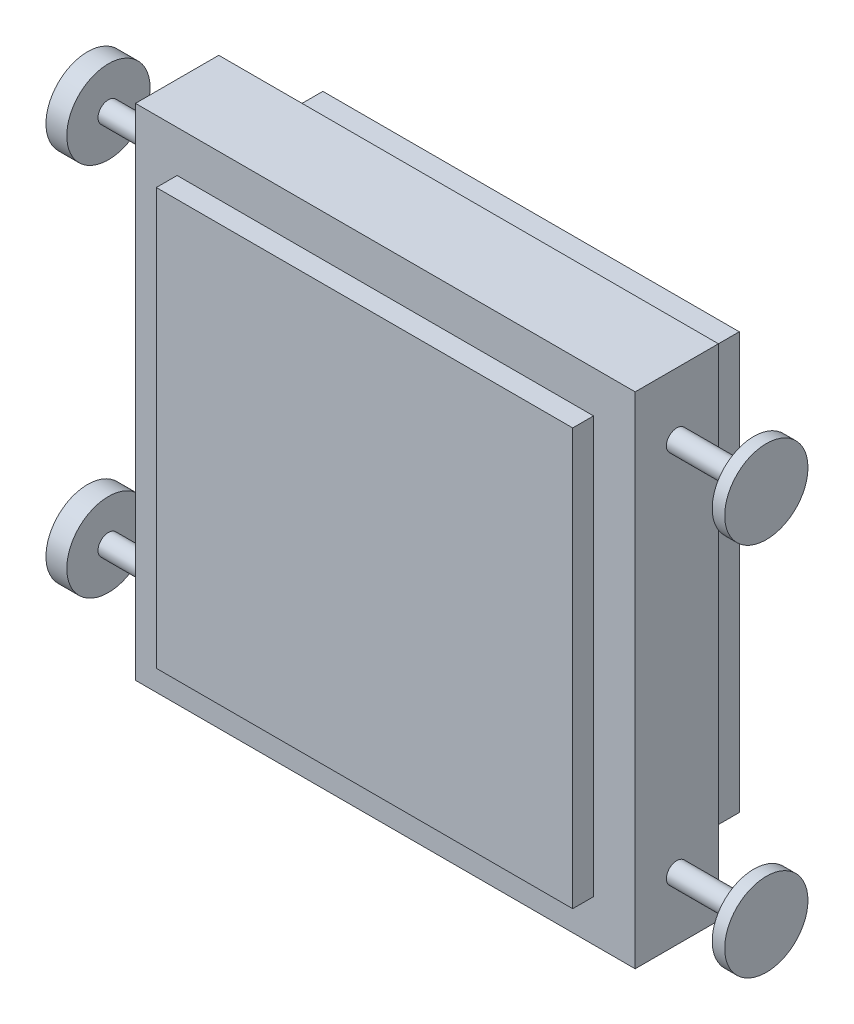
ISO-10303-21;
HEADER;
FILE_DESCRIPTION(('STEP AP214'),'2;1');
FILE_NAME('part.step','',(''),(''),'','','');
FILE_SCHEMA(('AUTOMOTIVE_DESIGN { 1 0 10303 214 1 1 1 1 }'));
ENDSEC;
DATA;
#1=APPLICATION_CONTEXT('core data for automotive mechanical design processes');
#2=APPLICATION_PROTOCOL_DEFINITION('international standard','automotive_design',2000,#1);
#3=PRODUCT_CONTEXT('',#1,'mechanical');
#4=PRODUCT('Part','Part','',(#3));
#5=PRODUCT_RELATED_PRODUCT_CATEGORY('part','',(#4));
#6=PRODUCT_DEFINITION_FORMATION('','',#4);
#7=PRODUCT_DEFINITION_CONTEXT('part definition',#1,'design');
#8=PRODUCT_DEFINITION('design','',#6,#7);
#9=PRODUCT_DEFINITION_SHAPE('','',#8);
#10=(LENGTH_UNIT() NAMED_UNIT(*) SI_UNIT(.MILLI.,.METRE.));
#11=(NAMED_UNIT(*) PLANE_ANGLE_UNIT() SI_UNIT($,.RADIAN.));
#12=(NAMED_UNIT(*) SI_UNIT($,.STERADIAN.) SOLID_ANGLE_UNIT());
#13=UNCERTAINTY_MEASURE_WITH_UNIT(LENGTH_MEASURE(1.E-05),#10,'distance_accuracy_value','');
#14=(GEOMETRIC_REPRESENTATION_CONTEXT(3) GLOBAL_UNCERTAINTY_ASSIGNED_CONTEXT((#13)) GLOBAL_UNIT_ASSIGNED_CONTEXT((#10,
#11,#12)) REPRESENTATION_CONTEXT('',''));
#15=CARTESIAN_POINT('',(0.,0.,0.));
#16=DIRECTION('',(0.,0.,1.));
#17=DIRECTION('',(1.,0.,0.));
#18=AXIS2_PLACEMENT_3D('',#15,#16,#17);
#19=CARTESIAN_POINT('',(815.,450.,275.));
#20=DIRECTION('',(-1.,0.,0.));
#21=DIRECTION('',(0.,0.,1.));
#22=AXIS2_PLACEMENT_3D('',#19,#20,#21);
#23=CYLINDRICAL_SURFACE('',#22,25.);
#24=CARTESIAN_POINT('',(600.,450.,275.));
#25=DIRECTION('',(-1.,0.,0.));
#26=DIRECTION('',(0.,-1.,0.));
#27=AXIS2_PLACEMENT_3D('',#24,#25,#26);
#28=CIRCLE('',#27,25.);
#29=CARTESIAN_POINT('',(600.,425.,275.));
#30=VERTEX_POINT('',#29);
#31=EDGE_CURVE('E187',#30,#30,#28,.F.);
#32=ORIENTED_EDGE('',*,*,#31,.T.);
#33=EDGE_LOOP('',(#32));
#34=FACE_BOUND('',#33,.T.);
#35=CARTESIAN_POINT('',(785.,450.,275.));
#36=DIRECTION('',(1.,0.,0.));
#37=DIRECTION('',(0.,0.,-1.));
#38=AXIS2_PLACEMENT_3D('',#35,#36,#37);
#39=CIRCLE('',#38,25.);
#40=CARTESIAN_POINT('',(785.,450.,250.));
#41=VERTEX_POINT('',#40);
#42=EDGE_CURVE('E12',#41,#41,#39,.T.);
#43=ORIENTED_EDGE('',*,*,#42,.F.);
#44=EDGE_LOOP('',(#43));
#45=FACE_BOUND('',#44,.T.);
#46=ADVANCED_FACE('F54',(#34,#45),#23,.T.);
#47=CARTESIAN_POINT('',(815.,-450.,275.));
#48=DIRECTION('',(-1.,0.,0.));
#49=DIRECTION('',(0.,0.,1.));
#50=AXIS2_PLACEMENT_3D('',#47,#48,#49);
#51=CYLINDRICAL_SURFACE('',#50,25.);
#52=CARTESIAN_POINT('',(600.,-450.,275.));
#53=DIRECTION('',(-1.,0.,0.));
#54=DIRECTION('',(0.,-1.,0.));
#55=AXIS2_PLACEMENT_3D('',#52,#53,#54);
#56=CIRCLE('',#55,25.);
#57=CARTESIAN_POINT('',(600.,-475.,275.));
#58=VERTEX_POINT('',#57);
#59=EDGE_CURVE('E200',#58,#58,#56,.F.);
#60=ORIENTED_EDGE('',*,*,#59,.T.);
#61=EDGE_LOOP('',(#60));
#62=FACE_BOUND('',#61,.T.);
#63=CARTESIAN_POINT('',(785.,-450.,275.));
#64=DIRECTION('',(1.,0.,0.));
#65=DIRECTION('',(0.,0.,-1.));
#66=AXIS2_PLACEMENT_3D('',#63,#64,#65);
#67=CIRCLE('',#66,25.);
#68=CARTESIAN_POINT('',(785.,-450.,250.));
#69=VERTEX_POINT('',#68);
#70=EDGE_CURVE('E62',#69,#69,#67,.T.);
#71=ORIENTED_EDGE('',*,*,#70,.F.);
#72=EDGE_LOOP('',(#71));
#73=FACE_BOUND('',#72,.T.);
#74=ADVANCED_FACE('F251',(#62,#73),#51,.T.);
#75=CARTESIAN_POINT('',(0.,0.,375.));
#76=DIRECTION('',(0.,0.,1.));
#77=DIRECTION('',(1.,0.,0.));
#78=AXIS2_PLACEMENT_3D('',#75,#76,#77);
#79=PLANE('',#78);
#80=DIRECTION('',(0.,-1.,0.));
#81=VECTOR('',#80,1.);
#82=CARTESIAN_POINT('',(-600.,600.,375.));
#83=LINE('',#82,#81);
#84=CARTESIAN_POINT('',(-600.,600.,375.));
#85=VERTEX_POINT('',#84);
#86=CARTESIAN_POINT('',(-600.,-600.,375.));
#87=VERTEX_POINT('',#86);
#88=EDGE_CURVE('E158',#85,#87,#83,.T.);
#89=ORIENTED_EDGE('',*,*,#88,.T.);
#90=DIRECTION('',(1.,0.,0.));
#91=VECTOR('',#90,1.);
#92=CARTESIAN_POINT('',(-600.,-600.,375.));
#93=LINE('',#92,#91);
#94=CARTESIAN_POINT('',(600.,-600.,375.));
#95=VERTEX_POINT('',#94);
#96=EDGE_CURVE('E161',#87,#95,#93,.T.);
#97=ORIENTED_EDGE('',*,*,#96,.T.);
#98=DIRECTION('',(0.,1.,0.));
#99=VECTOR('',#98,1.);
#100=CARTESIAN_POINT('',(600.,600.,375.));
#101=LINE('',#100,#99);
#102=CARTESIAN_POINT('',(600.,600.,375.));
#103=VERTEX_POINT('',#102);
#104=EDGE_CURVE('E164',#95,#103,#101,.T.);
#105=ORIENTED_EDGE('',*,*,#104,.T.);
#106=DIRECTION('',(-1.,0.,0.));
#107=VECTOR('',#106,1.);
#108=CARTESIAN_POINT('',(-600.,600.,375.));
#109=LINE('',#108,#107);
#110=EDGE_CURVE('E166',#103,#85,#109,.T.);
#111=ORIENTED_EDGE('',*,*,#110,.T.);
#112=EDGE_LOOP('',(#89,#97,#105,#111));
#113=FACE_BOUND('',#112,.T.);
#114=DIRECTION('',(1.,0.,0.));
#115=VECTOR('',#114,1.);
#116=CARTESIAN_POINT('',(-500.,-500.,375.));
#117=LINE('',#116,#115);
#118=CARTESIAN_POINT('',(-500.,-500.,375.));
#119=VERTEX_POINT('',#118);
#120=CARTESIAN_POINT('',(500.,-500.,375.));
#121=VERTEX_POINT('',#120);
#122=EDGE_CURVE('E127',#119,#121,#117,.T.);
#123=ORIENTED_EDGE('',*,*,#122,.F.);
#124=DIRECTION('',(0.,-1.,0.));
#125=VECTOR('',#124,1.);
#126=CARTESIAN_POINT('',(-500.,500.,375.));
#127=LINE('',#126,#125);
#128=CARTESIAN_POINT('',(-500.,500.,375.));
#129=VERTEX_POINT('',#128);
#130=EDGE_CURVE('E119',#129,#119,#127,.T.);
#131=ORIENTED_EDGE('',*,*,#130,.F.);
#132=DIRECTION('',(-1.,0.,0.));
#133=VECTOR('',#132,1.);
#134=CARTESIAN_POINT('',(-500.,500.,375.));
#135=LINE('',#134,#133);
#136=CARTESIAN_POINT('',(500.,500.,375.));
#137=VERTEX_POINT('',#136);
#138=EDGE_CURVE('E142',#137,#129,#135,.T.);
#139=ORIENTED_EDGE('',*,*,#138,.F.);
#140=DIRECTION('',(0.,1.,0.));
#141=VECTOR('',#140,1.);
#142=CARTESIAN_POINT('',(500.,500.,375.));
#143=LINE('',#142,#141);
#144=EDGE_CURVE('E140',#121,#137,#143,.T.);
#145=ORIENTED_EDGE('',*,*,#144,.F.);
#146=EDGE_LOOP('',(#123,#131,#139,#145));
#147=FACE_BOUND('',#146,.T.);
#148=ADVANCED_FACE('F139',(#113,#147),#79,.T.);
#149=CARTESIAN_POINT('',(0.,0.,175.));
#150=DIRECTION('',(0.,0.,1.));
#151=DIRECTION('',(1.,0.,0.));
#152=AXIS2_PLACEMENT_3D('',#149,#150,#151);
#153=PLANE('',#152);
#154=DIRECTION('',(0.,-1.,0.));
#155=VECTOR('',#154,1.);
#156=CARTESIAN_POINT('',(-600.,600.,175.));
#157=LINE('',#156,#155);
#158=CARTESIAN_POINT('',(-600.,600.,175.));
#159=VERTEX_POINT('',#158);
#160=CARTESIAN_POINT('',(-600.,-600.,175.));
#161=VERTEX_POINT('',#160);
#162=EDGE_CURVE('E135',#159,#161,#157,.T.);
#163=ORIENTED_EDGE('',*,*,#162,.F.);
#164=DIRECTION('',(-1.,0.,0.));
#165=VECTOR('',#164,1.);
#166=CARTESIAN_POINT('',(-600.,600.,175.));
#167=LINE('',#166,#165);
#168=CARTESIAN_POINT('',(600.,600.,175.));
#169=VERTEX_POINT('',#168);
#170=EDGE_CURVE('E162',#169,#159,#167,.T.);
#171=ORIENTED_EDGE('',*,*,#170,.F.);
#172=DIRECTION('',(0.,1.,0.));
#173=VECTOR('',#172,1.);
#174=CARTESIAN_POINT('',(600.,600.,175.));
#175=LINE('',#174,#173);
#176=CARTESIAN_POINT('',(600.,-600.,175.));
#177=VERTEX_POINT('',#176);
#178=EDGE_CURVE('E173',#177,#169,#175,.T.);
#179=ORIENTED_EDGE('',*,*,#178,.F.);
#180=DIRECTION('',(1.,0.,0.));
#181=VECTOR('',#180,1.);
#182=CARTESIAN_POINT('',(-600.,-600.,175.));
#183=LINE('',#182,#181);
#184=EDGE_CURVE('E171',#161,#177,#183,.T.);
#185=ORIENTED_EDGE('',*,*,#184,.F.);
#186=EDGE_LOOP('',(#163,#171,#179,#185));
#187=FACE_BOUND('',#186,.T.);
#188=DIRECTION('',(0.,-1.,0.));
#189=VECTOR('',#188,1.);
#190=CARTESIAN_POINT('',(-500.,500.,175.));
#191=LINE('',#190,#189);
#192=CARTESIAN_POINT('',(-500.,500.,175.));
#193=VERTEX_POINT('',#192);
#194=CARTESIAN_POINT('',(-500.,-500.,175.));
#195=VERTEX_POINT('',#194);
#196=EDGE_CURVE('E77',#193,#195,#191,.T.);
#197=ORIENTED_EDGE('',*,*,#196,.T.);
#198=DIRECTION('',(1.,0.,0.));
#199=VECTOR('',#198,1.);
#200=CARTESIAN_POINT('',(-500.,-500.,175.));
#201=LINE('',#200,#199);
#202=CARTESIAN_POINT('',(500.,-500.,175.));
#203=VERTEX_POINT('',#202);
#204=EDGE_CURVE('E134',#195,#203,#201,.T.);
#205=ORIENTED_EDGE('',*,*,#204,.T.);
#206=DIRECTION('',(0.,1.,0.));
#207=VECTOR('',#206,1.);
#208=CARTESIAN_POINT('',(500.,500.,175.));
#209=LINE('',#208,#207);
#210=CARTESIAN_POINT('',(500.,500.,175.));
#211=VERTEX_POINT('',#210);
#212=EDGE_CURVE('E150',#203,#211,#209,.T.);
#213=ORIENTED_EDGE('',*,*,#212,.T.);
#214=DIRECTION('',(-1.,0.,0.));
#215=VECTOR('',#214,1.);
#216=CARTESIAN_POINT('',(-500.,500.,175.));
#217=LINE('',#216,#215);
#218=EDGE_CURVE('E128',#211,#193,#217,.T.);
#219=ORIENTED_EDGE('',*,*,#218,.T.);
#220=EDGE_LOOP('',(#197,#205,#213,#219));
#221=FACE_BOUND('',#220,.T.);
#222=ADVANCED_FACE('F220',(#187,#221),#153,.F.);
#223=CARTESIAN_POINT('',(-600.,600.,375.));
#224=DIRECTION('',(1.,0.,0.));
#225=DIRECTION('',(0.,1.,0.));
#226=AXIS2_PLACEMENT_3D('',#223,#224,#225);
#227=PLANE('',#226);
#228=CARTESIAN_POINT('',(-600.,-450.,275.));
#229=DIRECTION('',(1.,0.,0.));
#230=DIRECTION('',(0.,1.,0.));
#231=AXIS2_PLACEMENT_3D('',#228,#229,#230);
#232=CIRCLE('',#231,25.);
#233=CARTESIAN_POINT('',(-600.,-425.,275.));
#234=VERTEX_POINT('',#233);
#235=EDGE_CURVE('E196',#234,#234,#232,.F.);
#236=ORIENTED_EDGE('',*,*,#235,.F.);
#237=EDGE_LOOP('',(#236));
#238=FACE_BOUND('',#237,.T.);
#239=CARTESIAN_POINT('',(-600.,450.,275.));
#240=DIRECTION('',(1.,0.,0.));
#241=DIRECTION('',(0.,1.,0.));
#242=AXIS2_PLACEMENT_3D('',#239,#240,#241);
#243=CIRCLE('',#242,25.);
#244=CARTESIAN_POINT('',(-600.,475.,275.));
#245=VERTEX_POINT('',#244);
#246=EDGE_CURVE('E205',#245,#245,#243,.F.);
#247=ORIENTED_EDGE('',*,*,#246,.F.);
#248=EDGE_LOOP('',(#247));
#249=FACE_BOUND('',#248,.T.);
#250=ORIENTED_EDGE('',*,*,#162,.T.);
#251=DIRECTION('',(0.,0.,-1.));
#252=VECTOR('',#251,1.);
#253=CARTESIAN_POINT('',(-600.,-600.,375.));
#254=LINE('',#253,#252);
#255=EDGE_CURVE('E184',#87,#161,#254,.T.);
#256=ORIENTED_EDGE('',*,*,#255,.F.);
#257=ORIENTED_EDGE('',*,*,#88,.F.);
#258=DIRECTION('',(0.,0.,-1.));
#259=VECTOR('',#258,1.);
#260=CARTESIAN_POINT('',(-600.,600.,375.));
#261=LINE('',#260,#259);
#262=EDGE_CURVE('E168',#85,#159,#261,.T.);
#263=ORIENTED_EDGE('',*,*,#262,.T.);
#264=EDGE_LOOP('',(#250,#256,#257,#263));
#265=FACE_BOUND('',#264,.T.);
#266=ADVANCED_FACE('F56',(#238,#249,#265),#227,.F.);
#267=CARTESIAN_POINT('',(-600.,-600.,375.));
#268=DIRECTION('',(0.,1.,0.));
#269=DIRECTION('',(0.,0.,1.));
#270=AXIS2_PLACEMENT_3D('',#267,#268,#269);
#271=PLANE('',#270);
#272=ORIENTED_EDGE('',*,*,#184,.T.);
#273=DIRECTION('',(0.,0.,-1.));
#274=VECTOR('',#273,1.);
#275=CARTESIAN_POINT('',(600.,-600.,375.));
#276=LINE('',#275,#274);
#277=EDGE_CURVE('E181',#95,#177,#276,.T.);
#278=ORIENTED_EDGE('',*,*,#277,.F.);
#279=ORIENTED_EDGE('',*,*,#96,.F.);
#280=ORIENTED_EDGE('',*,*,#255,.T.);
#281=EDGE_LOOP('',(#272,#278,#279,#280));
#282=FACE_BOUND('',#281,.T.);
#283=ADVANCED_FACE('F219',(#282),#271,.F.);
#284=CARTESIAN_POINT('',(600.,600.,375.));
#285=DIRECTION('',(-1.,0.,0.));
#286=DIRECTION('',(0.,-1.,0.));
#287=AXIS2_PLACEMENT_3D('',#284,#285,#286);
#288=PLANE('',#287);
#289=ORIENTED_EDGE('',*,*,#59,.F.);
#290=EDGE_LOOP('',(#289));
#291=FACE_BOUND('',#290,.T.);
#292=ORIENTED_EDGE('',*,*,#31,.F.);
#293=EDGE_LOOP('',(#292));
#294=FACE_BOUND('',#293,.T.);
#295=ORIENTED_EDGE('',*,*,#178,.T.);
#296=DIRECTION('',(0.,0.,-1.));
#297=VECTOR('',#296,1.);
#298=CARTESIAN_POINT('',(600.,600.,375.));
#299=LINE('',#298,#297);
#300=EDGE_CURVE('E178',#103,#169,#299,.T.);
#301=ORIENTED_EDGE('',*,*,#300,.F.);
#302=ORIENTED_EDGE('',*,*,#104,.F.);
#303=ORIENTED_EDGE('',*,*,#277,.T.);
#304=EDGE_LOOP('',(#295,#301,#302,#303));
#305=FACE_BOUND('',#304,.T.);
#306=ADVANCED_FACE('F239',(#291,#294,#305),#288,.F.);
#307=CARTESIAN_POINT('',(-600.,600.,375.));
#308=DIRECTION('',(0.,-1.,0.));
#309=DIRECTION('',(0.,0.,-1.));
#310=AXIS2_PLACEMENT_3D('',#307,#308,#309);
#311=PLANE('',#310);
#312=ORIENTED_EDGE('',*,*,#170,.T.);
#313=ORIENTED_EDGE('',*,*,#262,.F.);
#314=ORIENTED_EDGE('',*,*,#110,.F.);
#315=ORIENTED_EDGE('',*,*,#300,.T.);
#316=EDGE_LOOP('',(#312,#313,#314,#315));
#317=FACE_BOUND('',#316,.T.);
#318=ADVANCED_FACE('F237',(#317),#311,.F.);
#319=CARTESIAN_POINT('',(-500.,500.,375.));
#320=DIRECTION('',(1.,0.,0.));
#321=DIRECTION('',(0.,1.,0.));
#322=AXIS2_PLACEMENT_3D('',#319,#320,#321);
#323=PLANE('',#322);
#324=CARTESIAN_POINT('',(-500.,-450.,275.));
#325=DIRECTION('',(1.,0.,0.));
#326=DIRECTION('',(0.,1.,0.));
#327=AXIS2_PLACEMENT_3D('',#324,#325,#326);
#328=CIRCLE('',#327,25.);
#329=CARTESIAN_POINT('',(-500.,-425.,275.));
#330=VERTEX_POINT('',#329);
#331=EDGE_CURVE('E191',#330,#330,#328,.F.);
#332=ORIENTED_EDGE('',*,*,#331,.T.);
#333=EDGE_LOOP('',(#332));
#334=FACE_BOUND('',#333,.T.);
#335=CARTESIAN_POINT('',(-500.,450.,275.));
#336=DIRECTION('',(1.,0.,0.));
#337=DIRECTION('',(0.,1.,0.));
#338=AXIS2_PLACEMENT_3D('',#335,#336,#337);
#339=CIRCLE('',#338,25.);
#340=CARTESIAN_POINT('',(-500.,475.,275.));
#341=VERTEX_POINT('',#340);
#342=EDGE_CURVE('E148',#341,#341,#339,.F.);
#343=ORIENTED_EDGE('',*,*,#342,.T.);
#344=EDGE_LOOP('',(#343));
#345=FACE_BOUND('',#344,.T.);
#346=ORIENTED_EDGE('',*,*,#196,.F.);
#347=DIRECTION('',(0.,0.,-1.));
#348=VECTOR('',#347,1.);
#349=CARTESIAN_POINT('',(-500.,500.,375.));
#350=LINE('',#349,#348);
#351=EDGE_CURVE('E123',#129,#193,#350,.T.);
#352=ORIENTED_EDGE('',*,*,#351,.F.);
#353=ORIENTED_EDGE('',*,*,#130,.T.);
#354=DIRECTION('',(0.,0.,-1.));
#355=VECTOR('',#354,1.);
#356=CARTESIAN_POINT('',(-500.,-500.,375.));
#357=LINE('',#356,#355);
#358=EDGE_CURVE('E122',#119,#195,#357,.T.);
#359=ORIENTED_EDGE('',*,*,#358,.T.);
#360=EDGE_LOOP('',(#346,#352,#353,#359));
#361=FACE_BOUND('',#360,.T.);
#362=ADVANCED_FACE('F121',(#334,#345,#361),#323,.T.);
#363=CARTESIAN_POINT('',(-500.,-500.,375.));
#364=DIRECTION('',(0.,1.,0.));
#365=DIRECTION('',(0.,0.,1.));
#366=AXIS2_PLACEMENT_3D('',#363,#364,#365);
#367=PLANE('',#366);
#368=ORIENTED_EDGE('',*,*,#204,.F.);
#369=ORIENTED_EDGE('',*,*,#358,.F.);
#370=ORIENTED_EDGE('',*,*,#122,.T.);
#371=DIRECTION('',(0.,0.,-1.));
#372=VECTOR('',#371,1.);
#373=CARTESIAN_POINT('',(500.,-500.,375.));
#374=LINE('',#373,#372);
#375=EDGE_CURVE('E136',#121,#203,#374,.T.);
#376=ORIENTED_EDGE('',*,*,#375,.T.);
#377=EDGE_LOOP('',(#368,#369,#370,#376));
#378=FACE_BOUND('',#377,.T.);
#379=ADVANCED_FACE('F131',(#378),#367,.T.);
#380=CARTESIAN_POINT('',(500.,500.,375.));
#381=DIRECTION('',(-1.,0.,0.));
#382=DIRECTION('',(0.,-1.,0.));
#383=AXIS2_PLACEMENT_3D('',#380,#381,#382);
#384=PLANE('',#383);
#385=CARTESIAN_POINT('',(500.,-450.,275.));
#386=DIRECTION('',(-1.,0.,0.));
#387=DIRECTION('',(0.,-1.,0.));
#388=AXIS2_PLACEMENT_3D('',#385,#386,#387);
#389=CIRCLE('',#388,25.);
#390=CARTESIAN_POINT('',(500.,-475.,275.));
#391=VERTEX_POINT('',#390);
#392=EDGE_CURVE('E192',#391,#391,#389,.F.);
#393=ORIENTED_EDGE('',*,*,#392,.T.);
#394=EDGE_LOOP('',(#393));
#395=FACE_BOUND('',#394,.T.);
#396=CARTESIAN_POINT('',(500.,450.,275.));
#397=DIRECTION('',(-1.,0.,0.));
#398=DIRECTION('',(0.,-1.,0.));
#399=AXIS2_PLACEMENT_3D('',#396,#397,#398);
#400=CIRCLE('',#399,25.);
#401=CARTESIAN_POINT('',(500.,425.,275.));
#402=VERTEX_POINT('',#401);
#403=EDGE_CURVE('E188',#402,#402,#400,.F.);
#404=ORIENTED_EDGE('',*,*,#403,.T.);
#405=EDGE_LOOP('',(#404));
#406=FACE_BOUND('',#405,.T.);
#407=ORIENTED_EDGE('',*,*,#212,.F.);
#408=ORIENTED_EDGE('',*,*,#375,.F.);
#409=ORIENTED_EDGE('',*,*,#144,.T.);
#410=DIRECTION('',(0.,0.,-1.));
#411=VECTOR('',#410,1.);
#412=CARTESIAN_POINT('',(500.,500.,375.));
#413=LINE('',#412,#411);
#414=EDGE_CURVE('E69',#137,#211,#413,.T.);
#415=ORIENTED_EDGE('',*,*,#414,.T.);
#416=EDGE_LOOP('',(#407,#408,#409,#415));
#417=FACE_BOUND('',#416,.T.);
#418=ADVANCED_FACE('F273',(#395,#406,#417),#384,.T.);
#419=CARTESIAN_POINT('',(-500.,500.,375.));
#420=DIRECTION('',(0.,-1.,0.));
#421=DIRECTION('',(0.,0.,-1.));
#422=AXIS2_PLACEMENT_3D('',#419,#420,#421);
#423=PLANE('',#422);
#424=ORIENTED_EDGE('',*,*,#218,.F.);
#425=ORIENTED_EDGE('',*,*,#414,.F.);
#426=ORIENTED_EDGE('',*,*,#138,.T.);
#427=ORIENTED_EDGE('',*,*,#351,.T.);
#428=EDGE_LOOP('',(#424,#425,#426,#427));
#429=FACE_BOUND('',#428,.T.);
#430=ADVANCED_FACE('F268',(#429),#423,.T.);
#431=ORIENTED_EDGE('',*,*,#342,.F.);
#432=EDGE_LOOP('',(#431));
#433=FACE_BOUND('',#432,.T.);
#434=ORIENTED_EDGE('',*,*,#403,.F.);
#435=EDGE_LOOP('',(#434));
#436=FACE_BOUND('',#435,.T.);
#437=ADVANCED_FACE('F254',(#433,#436),#23,.T.);
#438=CARTESIAN_POINT('',(-765.,450.,275.));
#439=DIRECTION('',(1.,0.,0.));
#440=DIRECTION('',(0.,0.,-1.));
#441=AXIS2_PLACEMENT_3D('',#438,#439,#440);
#442=CIRCLE('',#441,25.);
#443=CARTESIAN_POINT('',(-765.,450.,250.));
#444=VERTEX_POINT('',#443);
#445=EDGE_CURVE('E541',#444,#444,#442,.T.);
#446=ORIENTED_EDGE('',*,*,#445,.T.);
#447=EDGE_LOOP('',(#446));
#448=FACE_BOUND('',#447,.T.);
#449=ORIENTED_EDGE('',*,*,#246,.T.);
#450=EDGE_LOOP('',(#449));
#451=FACE_BOUND('',#450,.T.);
#452=ADVANCED_FACE('F215',(#448,#451),#23,.T.);
#453=ORIENTED_EDGE('',*,*,#331,.F.);
#454=EDGE_LOOP('',(#453));
#455=FACE_BOUND('',#454,.T.);
#456=ORIENTED_EDGE('',*,*,#392,.F.);
#457=EDGE_LOOP('',(#456));
#458=FACE_BOUND('',#457,.T.);
#459=ADVANCED_FACE('F261',(#455,#458),#51,.T.);
#460=CARTESIAN_POINT('',(-765.,-450.,275.));
#461=DIRECTION('',(1.,0.,0.));
#462=DIRECTION('',(0.,0.,-1.));
#463=AXIS2_PLACEMENT_3D('',#460,#461,#462);
#464=CIRCLE('',#463,25.);
#465=CARTESIAN_POINT('',(-765.,-450.,250.));
#466=VERTEX_POINT('',#465);
#467=EDGE_CURVE('E532',#466,#466,#464,.T.);
#468=ORIENTED_EDGE('',*,*,#467,.T.);
#469=EDGE_LOOP('',(#468));
#470=FACE_BOUND('',#469,.T.);
#471=ORIENTED_EDGE('',*,*,#235,.T.);
#472=EDGE_LOOP('',(#471));
#473=FACE_BOUND('',#472,.T.);
#474=ADVANCED_FACE('F260',(#470,#473),#51,.T.);
#475=CARTESIAN_POINT('',(785.,-450.,275.));
#476=DIRECTION('',(1.,0.,0.));
#477=DIRECTION('',(0.,0.,-1.));
#478=AXIS2_PLACEMENT_3D('',#475,#476,#477);
#479=CYLINDRICAL_SURFACE('',#478,100.);
#480=CARTESIAN_POINT('',(785.,-450.,275.));
#481=DIRECTION('',(1.,0.,0.));
#482=DIRECTION('',(0.,0.,-1.));
#483=AXIS2_PLACEMENT_3D('',#480,#481,#482);
#484=CIRCLE('',#483,100.);
#485=CARTESIAN_POINT('',(785.,-450.,175.));
#486=VERTEX_POINT('',#485);
#487=EDGE_CURVE('E194',#486,#486,#484,.T.);
#488=ORIENTED_EDGE('',*,*,#487,.T.);
#489=EDGE_LOOP('',(#488));
#490=FACE_BOUND('',#489,.T.);
#491=CARTESIAN_POINT('',(815.,-450.,275.));
#492=DIRECTION('',(1.,0.,0.));
#493=DIRECTION('',(0.,0.,-1.));
#494=AXIS2_PLACEMENT_3D('',#491,#492,#493);
#495=CIRCLE('',#494,100.);
#496=CARTESIAN_POINT('',(815.,-450.,175.));
#497=VERTEX_POINT('',#496);
#498=EDGE_CURVE('E517',#497,#497,#495,.T.);
#499=ORIENTED_EDGE('',*,*,#498,.F.);
#500=EDGE_LOOP('',(#499));
#501=FACE_BOUND('',#500,.T.);
#502=ADVANCED_FACE('F362',(#490,#501),#479,.T.);
#503=CARTESIAN_POINT('',(785.,-450.,275.));
#504=DIRECTION('',(1.,0.,0.));
#505=DIRECTION('',(0.,0.,-1.));
#506=AXIS2_PLACEMENT_3D('',#503,#504,#505);
#507=PLANE('',#506);
#508=ORIENTED_EDGE('',*,*,#70,.T.);
#509=EDGE_LOOP('',(#508));
#510=FACE_BOUND('',#509,.T.);
#511=ORIENTED_EDGE('',*,*,#487,.F.);
#512=EDGE_LOOP('',(#511));
#513=FACE_BOUND('',#512,.T.);
#514=ADVANCED_FACE('F367',(#510,#513),#507,.F.);
#515=CARTESIAN_POINT('',(815.,0.,0.));
#516=DIRECTION('',(1.,0.,0.));
#517=DIRECTION('',(0.,0.,-1.));
#518=AXIS2_PLACEMENT_3D('',#515,#516,#517);
#519=PLANE('',#518);
#520=ORIENTED_EDGE('',*,*,#498,.T.);
#521=EDGE_LOOP('',(#520));
#522=FACE_BOUND('',#521,.T.);
#523=ADVANCED_FACE('F378',(#522),#519,.T.);
#524=CARTESIAN_POINT('',(785.,450.,275.));
#525=DIRECTION('',(1.,0.,0.));
#526=DIRECTION('',(0.,0.,-1.));
#527=AXIS2_PLACEMENT_3D('',#524,#525,#526);
#528=CYLINDRICAL_SURFACE('',#527,100.);
#529=CARTESIAN_POINT('',(785.,450.,275.));
#530=DIRECTION('',(1.,0.,0.));
#531=DIRECTION('',(0.,0.,-1.));
#532=AXIS2_PLACEMENT_3D('',#529,#530,#531);
#533=CIRCLE('',#532,100.);
#534=CARTESIAN_POINT('',(785.,450.,175.));
#535=VERTEX_POINT('',#534);
#536=EDGE_CURVE('E520',#535,#535,#533,.T.);
#537=ORIENTED_EDGE('',*,*,#536,.T.);
#538=EDGE_LOOP('',(#537));
#539=FACE_BOUND('',#538,.T.);
#540=CARTESIAN_POINT('',(815.,450.,275.));
#541=DIRECTION('',(1.,0.,0.));
#542=DIRECTION('',(0.,0.,-1.));
#543=AXIS2_PLACEMENT_3D('',#540,#541,#542);
#544=CIRCLE('',#543,100.);
#545=CARTESIAN_POINT('',(815.,450.,175.));
#546=VERTEX_POINT('',#545);
#547=EDGE_CURVE('E523',#546,#546,#544,.T.);
#548=ORIENTED_EDGE('',*,*,#547,.F.);
#549=EDGE_LOOP('',(#548));
#550=FACE_BOUND('',#549,.T.);
#551=ADVANCED_FACE('F387',(#539,#550),#528,.T.);
#552=CARTESIAN_POINT('',(785.,450.,275.));
#553=DIRECTION('',(1.,0.,0.));
#554=DIRECTION('',(0.,0.,-1.));
#555=AXIS2_PLACEMENT_3D('',#552,#553,#554);
#556=PLANE('',#555);
#557=ORIENTED_EDGE('',*,*,#42,.T.);
#558=EDGE_LOOP('',(#557));
#559=FACE_BOUND('',#558,.T.);
#560=ORIENTED_EDGE('',*,*,#536,.F.);
#561=EDGE_LOOP('',(#560));
#562=FACE_BOUND('',#561,.T.);
#563=ADVANCED_FACE('F398',(#559,#562),#556,.F.);
#564=CARTESIAN_POINT('',(815.,0.,0.));
#565=DIRECTION('',(1.,0.,0.));
#566=DIRECTION('',(0.,0.,-1.));
#567=AXIS2_PLACEMENT_3D('',#564,#565,#566);
#568=PLANE('',#567);
#569=ORIENTED_EDGE('',*,*,#547,.T.);
#570=EDGE_LOOP('',(#569));
#571=FACE_BOUND('',#570,.T.);
#572=ADVANCED_FACE('F408',(#571),#568,.T.);
#573=CARTESIAN_POINT('',(-765.,-450.,275.));
#574=DIRECTION('',(1.,0.,0.));
#575=DIRECTION('',(0.,0.,-1.));
#576=AXIS2_PLACEMENT_3D('',#573,#574,#575);
#577=PLANE('',#576);
#578=CARTESIAN_POINT('',(-765.,-450.,275.));
#579=DIRECTION('',(1.,0.,0.));
#580=DIRECTION('',(0.,0.,-1.));
#581=AXIS2_PLACEMENT_3D('',#578,#579,#580);
#582=CIRCLE('',#581,100.);
#583=CARTESIAN_POINT('',(-765.,-450.,175.));
#584=VERTEX_POINT('',#583);
#585=EDGE_CURVE('E526',#584,#584,#582,.T.);
#586=ORIENTED_EDGE('',*,*,#585,.T.);
#587=EDGE_LOOP('',(#586));
#588=FACE_BOUND('',#587,.T.);
#589=ORIENTED_EDGE('',*,*,#467,.F.);
#590=EDGE_LOOP('',(#589));
#591=FACE_BOUND('',#590,.T.);
#592=ADVANCED_FACE('F418',(#588,#591),#577,.T.);
#593=CARTESIAN_POINT('',(-765.,-450.,275.));
#594=DIRECTION('',(-1.,0.,0.));
#595=DIRECTION('',(0.,0.,1.));
#596=AXIS2_PLACEMENT_3D('',#593,#594,#595);
#597=CYLINDRICAL_SURFACE('',#596,100.);
#598=ORIENTED_EDGE('',*,*,#585,.F.);
#599=EDGE_LOOP('',(#598));
#600=FACE_BOUND('',#599,.T.);
#601=CARTESIAN_POINT('',(-815.,-450.,275.));
#602=DIRECTION('',(1.,0.,0.));
#603=DIRECTION('',(0.,0.,-1.));
#604=AXIS2_PLACEMENT_3D('',#601,#602,#603);
#605=CIRCLE('',#604,100.);
#606=CARTESIAN_POINT('',(-815.,-450.,175.));
#607=VERTEX_POINT('',#606);
#608=EDGE_CURVE('E529',#607,#607,#605,.T.);
#609=ORIENTED_EDGE('',*,*,#608,.T.);
#610=EDGE_LOOP('',(#609));
#611=FACE_BOUND('',#610,.T.);
#612=ADVANCED_FACE('F444',(#600,#611),#597,.T.);
#613=CARTESIAN_POINT('',(-815.,0.,0.));
#614=DIRECTION('',(1.,0.,0.));
#615=DIRECTION('',(0.,0.,-1.));
#616=AXIS2_PLACEMENT_3D('',#613,#614,#615);
#617=PLANE('',#616);
#618=ORIENTED_EDGE('',*,*,#608,.F.);
#619=EDGE_LOOP('',(#618));
#620=FACE_BOUND('',#619,.T.);
#621=ADVANCED_FACE('F454',(#620),#617,.F.);
#622=CARTESIAN_POINT('',(-765.,450.,275.));
#623=DIRECTION('',(1.,0.,0.));
#624=DIRECTION('',(0.,0.,-1.));
#625=AXIS2_PLACEMENT_3D('',#622,#623,#624);
#626=PLANE('',#625);
#627=CARTESIAN_POINT('',(-765.,450.,275.));
#628=DIRECTION('',(1.,0.,0.));
#629=DIRECTION('',(0.,0.,-1.));
#630=AXIS2_PLACEMENT_3D('',#627,#628,#629);
#631=CIRCLE('',#630,100.);
#632=CARTESIAN_POINT('',(-765.,450.,175.));
#633=VERTEX_POINT('',#632);
#634=EDGE_CURVE('E537',#633,#633,#631,.T.);
#635=ORIENTED_EDGE('',*,*,#634,.T.);
#636=EDGE_LOOP('',(#635));
#637=FACE_BOUND('',#636,.T.);
#638=ORIENTED_EDGE('',*,*,#445,.F.);
#639=EDGE_LOOP('',(#638));
#640=FACE_BOUND('',#639,.T.);
#641=ADVANCED_FACE('F464',(#637,#640),#626,.T.);
#642=CARTESIAN_POINT('',(-765.,450.,275.));
#643=DIRECTION('',(-1.,0.,0.));
#644=DIRECTION('',(0.,0.,1.));
#645=AXIS2_PLACEMENT_3D('',#642,#643,#644);
#646=CYLINDRICAL_SURFACE('',#645,100.);
#647=ORIENTED_EDGE('',*,*,#634,.F.);
#648=EDGE_LOOP('',(#647));
#649=FACE_BOUND('',#648,.T.);
#650=CARTESIAN_POINT('',(-815.,450.,275.));
#651=DIRECTION('',(1.,0.,0.));
#652=DIRECTION('',(0.,0.,-1.));
#653=AXIS2_PLACEMENT_3D('',#650,#651,#652);
#654=CIRCLE('',#653,100.);
#655=CARTESIAN_POINT('',(-815.,450.,175.));
#656=VERTEX_POINT('',#655);
#657=EDGE_CURVE('E538',#656,#656,#654,.T.);
#658=ORIENTED_EDGE('',*,*,#657,.T.);
#659=EDGE_LOOP('',(#658));
#660=FACE_BOUND('',#659,.T.);
#661=ADVANCED_FACE('F474',(#649,#660),#646,.T.);
#662=CARTESIAN_POINT('',(-815.,0.,0.));
#663=DIRECTION('',(1.,0.,0.));
#664=DIRECTION('',(0.,0.,-1.));
#665=AXIS2_PLACEMENT_3D('',#662,#663,#664);
#666=PLANE('',#665);
#667=ORIENTED_EDGE('',*,*,#657,.F.);
#668=EDGE_LOOP('',(#667));
#669=FACE_BOUND('',#668,.T.);
#670=ADVANCED_FACE('F484',(#669),#666,.F.);
#671=CLOSED_SHELL('',(#46,#74,#148,#222,#266,#283,#306,#318,#362,#379,#418,#430,#437,#452,#459,
#474,#502,#514,#523,#551,#563,#572,#592,#612,#621,#641,#661,#670));
#672=MANIFOLD_SOLID_BREP('B2',#671);
#673=CARTESIAN_POINT('',(500.,1.66533453693774E-13,425.));
#674=DIRECTION('',(1.,0.,0.));
#675=DIRECTION('',(0.,1.,0.));
#676=AXIS2_PLACEMENT_3D('',#673,#674,#675);
#677=PLANE('',#676);
#678=DIRECTION('',(0.,-1.,0.));
#679=VECTOR('',#678,1.);
#680=CARTESIAN_POINT('',(500.,1.66533453693774E-13,25.));
#681=LINE('',#680,#679);
#682=CARTESIAN_POINT('',(500.,500.,25.));
#683=VERTEX_POINT('',#682);
#684=CARTESIAN_POINT('',(500.,-500.,25.));
#685=VERTEX_POINT('',#684);
#686=EDGE_CURVE('E652',#683,#685,#681,.T.);
#687=ORIENTED_EDGE('',*,*,#686,.F.);
#688=DIRECTION('',(0.,0.,-1.));
#689=VECTOR('',#688,1.);
#690=CARTESIAN_POINT('',(500.,500.,425.));
#691=LINE('',#690,#689);
#692=CARTESIAN_POINT('',(500.,500.,425.));
#693=VERTEX_POINT('',#692);
#694=EDGE_CURVE('E52',#693,#683,#691,.T.);
#695=ORIENTED_EDGE('',*,*,#694,.F.);
#696=DIRECTION('',(0.,-1.,0.));
#697=VECTOR('',#696,1.);
#698=CARTESIAN_POINT('',(500.,1.66533453693774E-13,425.));
#699=LINE('',#698,#697);
#700=CARTESIAN_POINT('',(500.,-500.,425.));
#701=VERTEX_POINT('',#700);
#702=EDGE_CURVE('E643',#693,#701,#699,.T.);
#703=ORIENTED_EDGE('',*,*,#702,.T.);
#704=DIRECTION('',(0.,0.,-1.));
#705=VECTOR('',#704,1.);
#706=CARTESIAN_POINT('',(500.,-500.,425.));
#707=LINE('',#706,#705);
#708=EDGE_CURVE('E622',#701,#685,#707,.T.);
#709=ORIENTED_EDGE('',*,*,#708,.T.);
#710=EDGE_LOOP('',(#687,#695,#703,#709));
#711=FACE_BOUND('',#710,.T.);
#712=ADVANCED_FACE('F583',(#711),#677,.T.);
#713=CARTESIAN_POINT('',(0.,500.,425.));
#714=DIRECTION('',(0.,1.,0.));
#715=DIRECTION('',(0.,0.,1.));
#716=AXIS2_PLACEMENT_3D('',#713,#714,#715);
#717=PLANE('',#716);
#718=DIRECTION('',(1.,0.,0.));
#719=VECTOR('',#718,1.);
#720=CARTESIAN_POINT('',(0.,500.,25.));
#721=LINE('',#720,#719);
#722=CARTESIAN_POINT('',(-500.,500.,25.));
#723=VERTEX_POINT('',#722);
#724=EDGE_CURVE('E635',#723,#683,#721,.T.);
#725=ORIENTED_EDGE('',*,*,#724,.F.);
#726=DIRECTION('',(0.,0.,-1.));
#727=VECTOR('',#726,1.);
#728=CARTESIAN_POINT('',(-500.,500.,425.));
#729=LINE('',#728,#727);
#730=CARTESIAN_POINT('',(-500.,500.,425.));
#731=VERTEX_POINT('',#730);
#732=EDGE_CURVE('E592',#731,#723,#729,.T.);
#733=ORIENTED_EDGE('',*,*,#732,.F.);
#734=DIRECTION('',(1.,0.,0.));
#735=VECTOR('',#734,1.);
#736=CARTESIAN_POINT('',(0.,500.,425.));
#737=LINE('',#736,#735);
#738=EDGE_CURVE('E633',#731,#693,#737,.T.);
#739=ORIENTED_EDGE('',*,*,#738,.T.);
#740=ORIENTED_EDGE('',*,*,#694,.T.);
#741=EDGE_LOOP('',(#725,#733,#739,#740));
#742=FACE_BOUND('',#741,.T.);
#743=ADVANCED_FACE('F631',(#742),#717,.T.);
#744=CARTESIAN_POINT('',(-500.,0.,425.));
#745=DIRECTION('',(1.,0.,0.));
#746=DIRECTION('',(0.,1.,0.));
#747=AXIS2_PLACEMENT_3D('',#744,#745,#746);
#748=PLANE('',#747);
#749=DIRECTION('',(0.,-1.,0.));
#750=VECTOR('',#749,1.);
#751=CARTESIAN_POINT('',(-500.,0.,25.));
#752=LINE('',#751,#750);
#753=CARTESIAN_POINT('',(-500.,-500.,25.));
#754=VERTEX_POINT('',#753);
#755=EDGE_CURVE('E615',#723,#754,#752,.T.);
#756=ORIENTED_EDGE('',*,*,#755,.T.);
#757=DIRECTION('',(0.,0.,-1.));
#758=VECTOR('',#757,1.);
#759=CARTESIAN_POINT('',(-500.,-500.,425.));
#760=LINE('',#759,#758);
#761=CARTESIAN_POINT('',(-500.,-500.,425.));
#762=VERTEX_POINT('',#761);
#763=EDGE_CURVE('E637',#762,#754,#760,.T.);
#764=ORIENTED_EDGE('',*,*,#763,.F.);
#765=DIRECTION('',(0.,-1.,0.));
#766=VECTOR('',#765,1.);
#767=CARTESIAN_POINT('',(-500.,0.,425.));
#768=LINE('',#767,#766);
#769=EDGE_CURVE('E638',#731,#762,#768,.T.);
#770=ORIENTED_EDGE('',*,*,#769,.F.);
#771=ORIENTED_EDGE('',*,*,#732,.T.);
#772=EDGE_LOOP('',(#756,#764,#770,#771));
#773=FACE_BOUND('',#772,.T.);
#774=ADVANCED_FACE('F639',(#773),#748,.F.);
#775=CARTESIAN_POINT('',(0.,-500.,425.));
#776=DIRECTION('',(0.,1.,0.));
#777=DIRECTION('',(0.,0.,1.));
#778=AXIS2_PLACEMENT_3D('',#775,#776,#777);
#779=PLANE('',#778);
#780=DIRECTION('',(1.,0.,0.));
#781=VECTOR('',#780,1.);
#782=CARTESIAN_POINT('',(0.,-500.,25.));
#783=LINE('',#782,#781);
#784=EDGE_CURVE('E647',#754,#685,#783,.T.);
#785=ORIENTED_EDGE('',*,*,#784,.T.);
#786=ORIENTED_EDGE('',*,*,#708,.F.);
#787=DIRECTION('',(1.,0.,0.));
#788=VECTOR('',#787,1.);
#789=CARTESIAN_POINT('',(0.,-500.,425.));
#790=LINE('',#789,#788);
#791=EDGE_CURVE('E600',#762,#701,#790,.T.);
#792=ORIENTED_EDGE('',*,*,#791,.F.);
#793=ORIENTED_EDGE('',*,*,#763,.T.);
#794=EDGE_LOOP('',(#785,#786,#792,#793));
#795=FACE_BOUND('',#794,.T.);
#796=ADVANCED_FACE('F667',(#795),#779,.F.);
#797=CARTESIAN_POINT('',(0.,0.,425.));
#798=DIRECTION('',(0.,0.,1.));
#799=DIRECTION('',(1.,0.,0.));
#800=AXIS2_PLACEMENT_3D('',#797,#798,#799);
#801=PLANE('',#800);
#802=ORIENTED_EDGE('',*,*,#702,.F.);
#803=ORIENTED_EDGE('',*,*,#738,.F.);
#804=ORIENTED_EDGE('',*,*,#769,.T.);
#805=ORIENTED_EDGE('',*,*,#791,.T.);
#806=EDGE_LOOP('',(#802,#803,#804,#805));
#807=FACE_BOUND('',#806,.T.);
#808=ADVANCED_FACE('F642',(#807),#801,.T.);
#809=CARTESIAN_POINT('',(0.,0.,25.));
#810=DIRECTION('',(0.,0.,1.));
#811=DIRECTION('',(1.,0.,0.));
#812=AXIS2_PLACEMENT_3D('',#809,#810,#811);
#813=PLANE('',#812);
#814=ORIENTED_EDGE('',*,*,#686,.T.);
#815=ORIENTED_EDGE('',*,*,#784,.F.);
#816=ORIENTED_EDGE('',*,*,#755,.F.);
#817=ORIENTED_EDGE('',*,*,#724,.T.);
#818=EDGE_LOOP('',(#814,#815,#816,#817));
#819=FACE_BOUND('',#818,.T.);
#820=ADVANCED_FACE('F669',(#819),#813,.F.);
#821=CLOSED_SHELL('',(#712,#743,#774,#796,#808,#820));
#822=MANIFOLD_SOLID_BREP('B6',#821);
#823=CARTESIAN_POINT('',(-400.,400.,100.));
#824=DIRECTION('',(1.,0.,0.));
#825=DIRECTION('',(0.,0.,-1.));
#826=AXIS2_PLACEMENT_3D('',#823,#824,#825);
#827=PLANE('',#826);
#828=DIRECTION('',(0.,-1.,0.));
#829=VECTOR('',#828,1.);
#830=CARTESIAN_POINT('',(-400.,400.,0.));
#831=LINE('',#830,#829);
#832=CARTESIAN_POINT('',(-400.,400.,0.));
#833=VERTEX_POINT('',#832);
#834=CARTESIAN_POINT('',(-400.,-400.,0.));
#835=VERTEX_POINT('',#834);
#836=EDGE_CURVE('E782',#833,#835,#831,.T.);
#837=ORIENTED_EDGE('',*,*,#836,.T.);
#838=DIRECTION('',(0.,0.,-1.));
#839=VECTOR('',#838,1.);
#840=CARTESIAN_POINT('',(-400.,-400.,100.));
#841=LINE('',#840,#839);
#842=CARTESIAN_POINT('',(-400.,-400.,100.));
#843=VERTEX_POINT('',#842);
#844=EDGE_CURVE('E581',#843,#835,#841,.T.);
#845=ORIENTED_EDGE('',*,*,#844,.F.);
#846=DIRECTION('',(0.,-1.,0.));
#847=VECTOR('',#846,1.);
#848=CARTESIAN_POINT('',(-400.,400.,100.));
#849=LINE('',#848,#847);
#850=CARTESIAN_POINT('',(-400.,400.,100.));
#851=VERTEX_POINT('',#850);
#852=EDGE_CURVE('E770',#851,#843,#849,.T.);
#853=ORIENTED_EDGE('',*,*,#852,.F.);
#854=DIRECTION('',(0.,0.,-1.));
#855=VECTOR('',#854,1.);
#856=CARTESIAN_POINT('',(-400.,400.,100.));
#857=LINE('',#856,#855);
#858=EDGE_CURVE('E778',#851,#833,#857,.T.);
#859=ORIENTED_EDGE('',*,*,#858,.T.);
#860=EDGE_LOOP('',(#837,#845,#853,#859));
#861=FACE_BOUND('',#860,.T.);
#862=ADVANCED_FACE('F719',(#861),#827,.F.);
#863=CARTESIAN_POINT('',(-400.,-400.,100.));
#864=DIRECTION('',(0.,1.,0.));
#865=DIRECTION('',(0.,0.,1.));
#866=AXIS2_PLACEMENT_3D('',#863,#864,#865);
#867=PLANE('',#866);
#868=DIRECTION('',(1.,0.,0.));
#869=VECTOR('',#868,1.);
#870=CARTESIAN_POINT('',(-400.,-400.,0.));
#871=LINE('',#870,#869);
#872=CARTESIAN_POINT('',(400.,-400.,0.));
#873=VERTEX_POINT('',#872);
#874=EDGE_CURVE('E774',#835,#873,#871,.T.);
#875=ORIENTED_EDGE('',*,*,#874,.T.);
#876=DIRECTION('',(0.,0.,-1.));
#877=VECTOR('',#876,1.);
#878=CARTESIAN_POINT('',(400.,-400.,100.));
#879=LINE('',#878,#877);
#880=CARTESIAN_POINT('',(400.,-400.,100.));
#881=VERTEX_POINT('',#880);
#882=EDGE_CURVE('E727',#881,#873,#879,.T.);
#883=ORIENTED_EDGE('',*,*,#882,.F.);
#884=DIRECTION('',(1.,0.,0.));
#885=VECTOR('',#884,1.);
#886=CARTESIAN_POINT('',(-400.,-400.,100.));
#887=LINE('',#886,#885);
#888=EDGE_CURVE('E765',#843,#881,#887,.T.);
#889=ORIENTED_EDGE('',*,*,#888,.F.);
#890=ORIENTED_EDGE('',*,*,#844,.T.);
#891=EDGE_LOOP('',(#875,#883,#889,#890));
#892=FACE_BOUND('',#891,.T.);
#893=ADVANCED_FACE('F773',(#892),#867,.F.);
#894=CARTESIAN_POINT('',(400.,400.,100.));
#895=DIRECTION('',(-1.,0.,0.));
#896=DIRECTION('',(0.,-1.,0.));
#897=AXIS2_PLACEMENT_3D('',#894,#895,#896);
#898=PLANE('',#897);
#899=DIRECTION('',(0.,1.,0.));
#900=VECTOR('',#899,1.);
#901=CARTESIAN_POINT('',(400.,400.,0.));
#902=LINE('',#901,#900);
#903=CARTESIAN_POINT('',(400.,400.,0.));
#904=VERTEX_POINT('',#903);
#905=EDGE_CURVE('E752',#873,#904,#902,.T.);
#906=ORIENTED_EDGE('',*,*,#905,.T.);
#907=DIRECTION('',(0.,0.,-1.));
#908=VECTOR('',#907,1.);
#909=CARTESIAN_POINT('',(400.,400.,100.));
#910=LINE('',#909,#908);
#911=CARTESIAN_POINT('',(400.,400.,100.));
#912=VERTEX_POINT('',#911);
#913=EDGE_CURVE('E775',#912,#904,#910,.T.);
#914=ORIENTED_EDGE('',*,*,#913,.F.);
#915=DIRECTION('',(0.,1.,0.));
#916=VECTOR('',#915,1.);
#917=CARTESIAN_POINT('',(400.,400.,100.));
#918=LINE('',#917,#916);
#919=EDGE_CURVE('E768',#881,#912,#918,.T.);
#920=ORIENTED_EDGE('',*,*,#919,.F.);
#921=ORIENTED_EDGE('',*,*,#882,.T.);
#922=EDGE_LOOP('',(#906,#914,#920,#921));
#923=FACE_BOUND('',#922,.T.);
#924=ADVANCED_FACE('F776',(#923),#898,.F.);
#925=CARTESIAN_POINT('',(-400.,400.,100.));
#926=DIRECTION('',(0.,-1.,0.));
#927=DIRECTION('',(0.,0.,-1.));
#928=AXIS2_PLACEMENT_3D('',#925,#926,#927);
#929=PLANE('',#928);
#930=DIRECTION('',(-1.,0.,0.));
#931=VECTOR('',#930,1.);
#932=CARTESIAN_POINT('',(-400.,400.,0.));
#933=LINE('',#932,#931);
#934=EDGE_CURVE('E758',#904,#833,#933,.T.);
#935=ORIENTED_EDGE('',*,*,#934,.T.);
#936=ORIENTED_EDGE('',*,*,#858,.F.);
#937=DIRECTION('',(-1.,0.,0.));
#938=VECTOR('',#937,1.);
#939=CARTESIAN_POINT('',(-400.,400.,100.));
#940=LINE('',#939,#938);
#941=EDGE_CURVE('E735',#912,#851,#940,.T.);
#942=ORIENTED_EDGE('',*,*,#941,.F.);
#943=ORIENTED_EDGE('',*,*,#913,.T.);
#944=EDGE_LOOP('',(#935,#936,#942,#943));
#945=FACE_BOUND('',#944,.T.);
#946=ADVANCED_FACE('F789',(#945),#929,.F.);
#947=CARTESIAN_POINT('',(0.,0.,100.));
#948=DIRECTION('',(0.,0.,1.));
#949=DIRECTION('',(1.,0.,0.));
#950=AXIS2_PLACEMENT_3D('',#947,#948,#949);
#951=PLANE('',#950);
#952=ORIENTED_EDGE('',*,*,#852,.T.);
#953=ORIENTED_EDGE('',*,*,#888,.T.);
#954=ORIENTED_EDGE('',*,*,#919,.T.);
#955=ORIENTED_EDGE('',*,*,#941,.T.);
#956=EDGE_LOOP('',(#952,#953,#954,#955));
#957=FACE_BOUND('',#956,.T.);
#958=ADVANCED_FACE('F766',(#957),#951,.T.);
#959=CARTESIAN_POINT('',(0.,0.,0.));
#960=DIRECTION('',(0.,0.,1.));
#961=DIRECTION('',(1.,0.,0.));
#962=AXIS2_PLACEMENT_3D('',#959,#960,#961);
#963=PLANE('',#962);
#964=ORIENTED_EDGE('',*,*,#836,.F.);
#965=ORIENTED_EDGE('',*,*,#934,.F.);
#966=ORIENTED_EDGE('',*,*,#905,.F.);
#967=ORIENTED_EDGE('',*,*,#874,.F.);
#968=EDGE_LOOP('',(#964,#965,#966,#967));
#969=FACE_BOUND('',#968,.T.);
#970=ADVANCED_FACE('F792',(#969),#963,.F.);
#971=CLOSED_SHELL('',(#862,#893,#924,#946,#958,#970));
#972=MANIFOLD_SOLID_BREP('B46',#971);
#973=ADVANCED_BREP_SHAPE_REPRESENTATION('',(#18,#672,#822,#972),#14);
#974=SHAPE_DEFINITION_REPRESENTATION(#9,#973);
ENDSEC;
END-ISO-10303-21;
